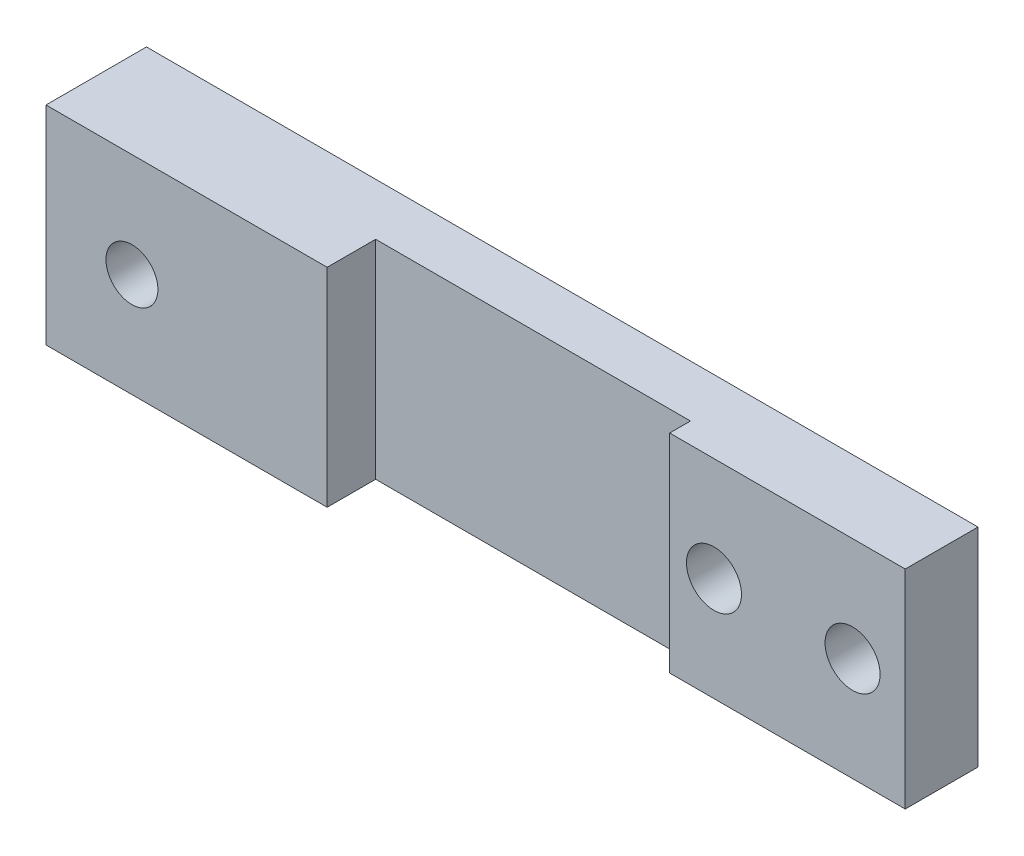
ISO-10303-21;
HEADER;
FILE_DESCRIPTION(('STEP AP214'),'2;1');
FILE_NAME('part.step','',(''),(''),'','','');
FILE_SCHEMA(('AUTOMOTIVE_DESIGN { 1 0 10303 214 1 1 1 1 }'));
ENDSEC;
DATA;
#1=APPLICATION_CONTEXT('core data for automotive mechanical design processes');
#2=APPLICATION_PROTOCOL_DEFINITION('international standard','automotive_design',2000,#1);
#3=PRODUCT_CONTEXT('',#1,'mechanical');
#4=PRODUCT('Part','Part','',(#3));
#5=PRODUCT_RELATED_PRODUCT_CATEGORY('part','',(#4));
#6=PRODUCT_DEFINITION_FORMATION('','',#4);
#7=PRODUCT_DEFINITION_CONTEXT('part definition',#1,'design');
#8=PRODUCT_DEFINITION('design','',#6,#7);
#9=PRODUCT_DEFINITION_SHAPE('','',#8);
#10=(LENGTH_UNIT() NAMED_UNIT(*) SI_UNIT(.MILLI.,.METRE.));
#11=(NAMED_UNIT(*) PLANE_ANGLE_UNIT() SI_UNIT($,.RADIAN.));
#12=(NAMED_UNIT(*) SI_UNIT($,.STERADIAN.) SOLID_ANGLE_UNIT());
#13=UNCERTAINTY_MEASURE_WITH_UNIT(LENGTH_MEASURE(1.E-05),#10,'distance_accuracy_value','');
#14=(GEOMETRIC_REPRESENTATION_CONTEXT(3) GLOBAL_UNCERTAINTY_ASSIGNED_CONTEXT((#13)) GLOBAL_UNIT_ASSIGNED_CONTEXT((#10,
#11,#12)) REPRESENTATION_CONTEXT('',''));
#15=CARTESIAN_POINT('',(0.,0.,0.));
#16=DIRECTION('',(0.,0.,1.));
#17=DIRECTION('',(1.,0.,0.));
#18=AXIS2_PLACEMENT_3D('',#15,#16,#17);
#19=CARTESIAN_POINT('',(0.,0.,9.525));
#20=DIRECTION('',(0.,0.,-1.));
#21=DIRECTION('',(-1.,0.,0.));
#22=AXIS2_PLACEMENT_3D('',#19,#20,#21);
#23=PLANE('',#22);
#24=DIRECTION('',(0.,1.,0.));
#25=VECTOR('',#24,1.);
#26=CARTESIAN_POINT('',(-24.6715220562594,-19.05,9.525));
#27=LINE('',#26,#25);
#28=CARTESIAN_POINT('',(-24.6715220562594,-19.05,9.525));
#29=VERTEX_POINT('',#28);
#30=CARTESIAN_POINT('',(-24.6715220562594,19.05,9.525));
#31=VERTEX_POINT('',#30);
#32=EDGE_CURVE('E47',#29,#31,#27,.T.);
#33=ORIENTED_EDGE('',*,*,#32,.F.);
#34=DIRECTION('',(1.,0.,0.));
#35=VECTOR('',#34,1.);
#36=CARTESIAN_POINT('',(76.2,-19.05,9.525));
#37=LINE('',#36,#35);
#38=CARTESIAN_POINT('',(33.02,-19.05,9.525));
#39=VERTEX_POINT('',#38);
#40=EDGE_CURVE('E159',#29,#39,#37,.T.);
#41=ORIENTED_EDGE('',*,*,#40,.T.);
#42=DIRECTION('',(0.,-1.,0.));
#43=VECTOR('',#42,1.);
#44=CARTESIAN_POINT('',(33.02,19.05,9.525));
#45=LINE('',#44,#43);
#46=CARTESIAN_POINT('',(33.02,19.05,9.525));
#47=VERTEX_POINT('',#46);
#48=EDGE_CURVE('E138',#47,#39,#45,.T.);
#49=ORIENTED_EDGE('',*,*,#48,.F.);
#50=DIRECTION('',(-1.,0.,0.));
#51=VECTOR('',#50,1.);
#52=CARTESIAN_POINT('',(76.2,19.05,9.525));
#53=LINE('',#52,#51);
#54=EDGE_CURVE('E52',#47,#31,#53,.T.);
#55=ORIENTED_EDGE('',*,*,#54,.T.);
#56=EDGE_LOOP('',(#33,#41,#49,#55));
#57=FACE_BOUND('',#56,.T.);
#58=ADVANCED_FACE('F32',(#57),#23,.F.);
#59=CARTESIAN_POINT('',(-76.2,19.05,9.525));
#60=DIRECTION('',(1.,0.,0.));
#61=DIRECTION('',(0.,1.,0.));
#62=AXIS2_PLACEMENT_3D('',#59,#60,#61);
#63=PLANE('',#62);
#64=DIRECTION('',(0.,-1.,0.));
#65=VECTOR('',#64,1.);
#66=CARTESIAN_POINT('',(-76.2,19.05,0.));
#67=LINE('',#66,#65);
#68=CARTESIAN_POINT('',(-76.2,19.05,0.));
#69=VERTEX_POINT('',#68);
#70=CARTESIAN_POINT('',(-76.2,-19.05,0.));
#71=VERTEX_POINT('',#70);
#72=EDGE_CURVE('E158',#69,#71,#67,.T.);
#73=ORIENTED_EDGE('',*,*,#72,.T.);
#74=DIRECTION('',(0.,0.,-1.));
#75=VECTOR('',#74,1.);
#76=CARTESIAN_POINT('',(-76.2,-19.05,9.525));
#77=LINE('',#76,#75);
#78=CARTESIAN_POINT('',(-76.2,-19.05,18.415));
#79=VERTEX_POINT('',#78);
#80=EDGE_CURVE('E11',#79,#71,#77,.T.);
#81=ORIENTED_EDGE('',*,*,#80,.F.);
#82=DIRECTION('',(0.,-1.,0.));
#83=VECTOR('',#82,1.);
#84=CARTESIAN_POINT('',(-76.2,19.05,18.415));
#85=LINE('',#84,#83);
#86=CARTESIAN_POINT('',(-76.2,19.05,18.415));
#87=VERTEX_POINT('',#86);
#88=EDGE_CURVE('E110',#87,#79,#85,.T.);
#89=ORIENTED_EDGE('',*,*,#88,.F.);
#90=DIRECTION('',(0.,0.,-1.));
#91=VECTOR('',#90,1.);
#92=CARTESIAN_POINT('',(-76.2,19.05,9.525));
#93=LINE('',#92,#91);
#94=EDGE_CURVE('E95',#87,#69,#93,.T.);
#95=ORIENTED_EDGE('',*,*,#94,.T.);
#96=EDGE_LOOP('',(#73,#81,#89,#95));
#97=FACE_BOUND('',#96,.T.);
#98=ADVANCED_FACE('F34',(#97),#63,.F.);
#99=CARTESIAN_POINT('',(76.2,-19.05,9.525));
#100=DIRECTION('',(0.,1.,0.));
#101=DIRECTION('',(-1.,0.,0.));
#102=AXIS2_PLACEMENT_3D('',#99,#100,#101);
#103=PLANE('',#102);
#104=DIRECTION('',(1.,0.,0.));
#105=VECTOR('',#104,1.);
#106=CARTESIAN_POINT('',(76.2,-19.05,0.));
#107=LINE('',#106,#105);
#108=CARTESIAN_POINT('',(76.2,-19.05,0.));
#109=VERTEX_POINT('',#108);
#110=EDGE_CURVE('E163',#71,#109,#107,.T.);
#111=ORIENTED_EDGE('',*,*,#110,.T.);
#112=DIRECTION('',(0.,0.,-1.));
#113=VECTOR('',#112,1.);
#114=CARTESIAN_POINT('',(76.2,-19.05,9.525));
#115=LINE('',#114,#113);
#116=CARTESIAN_POINT('',(76.2,-19.05,13.335));
#117=VERTEX_POINT('',#116);
#118=EDGE_CURVE('E40',#117,#109,#115,.T.);
#119=ORIENTED_EDGE('',*,*,#118,.F.);
#120=DIRECTION('',(1.,0.,0.));
#121=VECTOR('',#120,1.);
#122=CARTESIAN_POINT('',(33.02,-19.05,13.335));
#123=LINE('',#122,#121);
#124=CARTESIAN_POINT('',(33.02,-19.05,13.335));
#125=VERTEX_POINT('',#124);
#126=EDGE_CURVE('E144',#125,#117,#123,.T.);
#127=ORIENTED_EDGE('',*,*,#126,.F.);
#128=DIRECTION('',(0.,0.,-1.));
#129=VECTOR('',#128,1.);
#130=CARTESIAN_POINT('',(33.02,-19.05,13.335));
#131=LINE('',#130,#129);
#132=EDGE_CURVE('E150',#125,#39,#131,.T.);
#133=ORIENTED_EDGE('',*,*,#132,.T.);
#134=ORIENTED_EDGE('',*,*,#40,.F.);
#135=DIRECTION('',(0.,0.,-1.));
#136=VECTOR('',#135,1.);
#137=CARTESIAN_POINT('',(-24.6715220562594,-19.05,18.415));
#138=LINE('',#137,#136);
#139=CARTESIAN_POINT('',(-24.6715220562594,-19.05,18.415));
#140=VERTEX_POINT('',#139);
#141=EDGE_CURVE('E129',#140,#29,#138,.T.);
#142=ORIENTED_EDGE('',*,*,#141,.F.);
#143=DIRECTION('',(1.,0.,0.));
#144=VECTOR('',#143,1.);
#145=CARTESIAN_POINT('',(-76.2,-19.05,18.415));
#146=LINE('',#145,#144);
#147=EDGE_CURVE('E113',#79,#140,#146,.T.);
#148=ORIENTED_EDGE('',*,*,#147,.F.);
#149=ORIENTED_EDGE('',*,*,#80,.T.);
#150=EDGE_LOOP('',(#111,#119,#127,#133,#134,#142,#148,#149));
#151=FACE_BOUND('',#150,.T.);
#152=ADVANCED_FACE('F177',(#151),#103,.F.);
#153=CARTESIAN_POINT('',(76.2,19.05,9.525));
#154=DIRECTION('',(-1.,0.,0.));
#155=DIRECTION('',(0.,0.,1.));
#156=AXIS2_PLACEMENT_3D('',#153,#154,#155);
#157=PLANE('',#156);
#158=DIRECTION('',(0.,1.,0.));
#159=VECTOR('',#158,1.);
#160=CARTESIAN_POINT('',(76.2,19.05,0.));
#161=LINE('',#160,#159);
#162=CARTESIAN_POINT('',(76.2,19.05,0.));
#163=VERTEX_POINT('',#162);
#164=EDGE_CURVE('E165',#109,#163,#161,.T.);
#165=ORIENTED_EDGE('',*,*,#164,.T.);
#166=DIRECTION('',(0.,0.,-1.));
#167=VECTOR('',#166,1.);
#168=CARTESIAN_POINT('',(76.2,19.05,9.525));
#169=LINE('',#168,#167);
#170=CARTESIAN_POINT('',(76.2,19.05,13.335));
#171=VERTEX_POINT('',#170);
#172=EDGE_CURVE('E107',#171,#163,#169,.T.);
#173=ORIENTED_EDGE('',*,*,#172,.F.);
#174=DIRECTION('',(0.,1.,0.));
#175=VECTOR('',#174,1.);
#176=CARTESIAN_POINT('',(76.2,-19.05,13.335));
#177=LINE('',#176,#175);
#178=EDGE_CURVE('E147',#117,#171,#177,.T.);
#179=ORIENTED_EDGE('',*,*,#178,.F.);
#180=ORIENTED_EDGE('',*,*,#118,.T.);
#181=EDGE_LOOP('',(#165,#173,#179,#180));
#182=FACE_BOUND('',#181,.T.);
#183=ADVANCED_FACE('F172',(#182),#157,.F.);
#184=CARTESIAN_POINT('',(76.2,19.05,9.525));
#185=DIRECTION('',(0.,-1.,0.));
#186=DIRECTION('',(1.,0.,0.));
#187=AXIS2_PLACEMENT_3D('',#184,#185,#186);
#188=PLANE('',#187);
#189=DIRECTION('',(-1.,0.,0.));
#190=VECTOR('',#189,1.);
#191=CARTESIAN_POINT('',(76.2,19.05,0.));
#192=LINE('',#191,#190);
#193=EDGE_CURVE('E103',#163,#69,#192,.T.);
#194=ORIENTED_EDGE('',*,*,#193,.T.);
#195=ORIENTED_EDGE('',*,*,#94,.F.);
#196=DIRECTION('',(-1.,0.,0.));
#197=VECTOR('',#196,1.);
#198=CARTESIAN_POINT('',(-24.6715220562594,19.05,18.415));
#199=LINE('',#198,#197);
#200=CARTESIAN_POINT('',(-24.6715220562594,19.05,18.415));
#201=VERTEX_POINT('',#200);
#202=EDGE_CURVE('E100',#201,#87,#199,.T.);
#203=ORIENTED_EDGE('',*,*,#202,.F.);
#204=DIRECTION('',(0.,0.,-1.));
#205=VECTOR('',#204,1.);
#206=CARTESIAN_POINT('',(-24.6715220562594,19.05,18.415));
#207=LINE('',#206,#205);
#208=EDGE_CURVE('E126',#201,#31,#207,.T.);
#209=ORIENTED_EDGE('',*,*,#208,.T.);
#210=ORIENTED_EDGE('',*,*,#54,.F.);
#211=DIRECTION('',(0.,0.,-1.));
#212=VECTOR('',#211,1.);
#213=CARTESIAN_POINT('',(33.02,19.05,13.335));
#214=LINE('',#213,#212);
#215=CARTESIAN_POINT('',(33.02,19.05,13.335));
#216=VERTEX_POINT('',#215);
#217=EDGE_CURVE('E155',#216,#47,#214,.T.);
#218=ORIENTED_EDGE('',*,*,#217,.F.);
#219=DIRECTION('',(-1.,0.,0.));
#220=VECTOR('',#219,1.);
#221=CARTESIAN_POINT('',(76.2,19.05,13.335));
#222=LINE('',#221,#220);
#223=EDGE_CURVE('E139',#171,#216,#222,.T.);
#224=ORIENTED_EDGE('',*,*,#223,.F.);
#225=ORIENTED_EDGE('',*,*,#172,.T.);
#226=EDGE_LOOP('',(#194,#195,#203,#209,#210,#218,#224,#225));
#227=FACE_BOUND('',#226,.T.);
#228=ADVANCED_FACE('F97',(#227),#188,.F.);
#229=CARTESIAN_POINT('',(0.,0.,0.));
#230=DIRECTION('',(0.,0.,-1.));
#231=DIRECTION('',(-1.,0.,0.));
#232=AXIS2_PLACEMENT_3D('',#229,#230,#231);
#233=PLANE('',#232);
#234=CARTESIAN_POINT('',(-60.452,0.,0.));
#235=DIRECTION('',(0.,0.,1.));
#236=DIRECTION('',(1.,0.,0.));
#237=AXIS2_PLACEMENT_3D('',#234,#235,#236);
#238=CIRCLE('',#237,4.7625);
#239=CARTESIAN_POINT('',(-55.6895,0.,0.));
#240=VERTEX_POINT('',#239);
#241=EDGE_CURVE('E316',#240,#240,#238,.T.);
#242=ORIENTED_EDGE('',*,*,#241,.T.);
#243=EDGE_LOOP('',(#242));
#244=FACE_BOUND('',#243,.T.);
#245=CARTESIAN_POINT('',(66.548,0.,0.));
#246=DIRECTION('',(0.,0.,-1.));
#247=DIRECTION('',(-1.,0.,0.));
#248=AXIS2_PLACEMENT_3D('',#245,#246,#247);
#249=CIRCLE('',#248,5.04189999999999);
#250=CARTESIAN_POINT('',(61.5061,0.,0.));
#251=VERTEX_POINT('',#250);
#252=EDGE_CURVE('E321',#251,#251,#249,.T.);
#253=ORIENTED_EDGE('',*,*,#252,.F.);
#254=EDGE_LOOP('',(#253));
#255=FACE_BOUND('',#254,.T.);
#256=CARTESIAN_POINT('',(41.148,0.,0.));
#257=DIRECTION('',(0.,0.,-1.));
#258=DIRECTION('',(-1.,0.,0.));
#259=AXIS2_PLACEMENT_3D('',#256,#257,#258);
#260=CIRCLE('',#259,5.04189999999999);
#261=CARTESIAN_POINT('',(36.1061,0.,0.));
#262=VERTEX_POINT('',#261);
#263=EDGE_CURVE('E120',#262,#262,#260,.T.);
#264=ORIENTED_EDGE('',*,*,#263,.F.);
#265=EDGE_LOOP('',(#264));
#266=FACE_BOUND('',#265,.T.);
#267=ORIENTED_EDGE('',*,*,#72,.F.);
#268=ORIENTED_EDGE('',*,*,#193,.F.);
#269=ORIENTED_EDGE('',*,*,#164,.F.);
#270=ORIENTED_EDGE('',*,*,#110,.F.);
#271=EDGE_LOOP('',(#267,#268,#269,#270));
#272=FACE_BOUND('',#271,.T.);
#273=ADVANCED_FACE('F176',(#244,#255,#266,#272),#233,.T.);
#274=CARTESIAN_POINT('',(33.02,19.05,13.335));
#275=DIRECTION('',(1.,0.,0.));
#276=DIRECTION('',(0.,0.,-1.));
#277=AXIS2_PLACEMENT_3D('',#274,#275,#276);
#278=PLANE('',#277);
#279=ORIENTED_EDGE('',*,*,#48,.T.);
#280=ORIENTED_EDGE('',*,*,#132,.F.);
#281=DIRECTION('',(0.,-1.,0.));
#282=VECTOR('',#281,1.);
#283=CARTESIAN_POINT('',(33.02,19.05,13.335));
#284=LINE('',#283,#282);
#285=EDGE_CURVE('E142',#216,#125,#284,.T.);
#286=ORIENTED_EDGE('',*,*,#285,.F.);
#287=ORIENTED_EDGE('',*,*,#217,.T.);
#288=EDGE_LOOP('',(#279,#280,#286,#287));
#289=FACE_BOUND('',#288,.T.);
#290=ADVANCED_FACE('F184',(#289),#278,.F.);
#291=CARTESIAN_POINT('',(0.,0.,13.335));
#292=DIRECTION('',(0.,0.,1.));
#293=DIRECTION('',(1.,0.,0.));
#294=AXIS2_PLACEMENT_3D('',#291,#292,#293);
#295=PLANE('',#294);
#296=CARTESIAN_POINT('',(41.148,0.,13.335));
#297=DIRECTION('',(0.,0.,-1.));
#298=DIRECTION('',(-1.,0.,0.));
#299=AXIS2_PLACEMENT_3D('',#296,#297,#298);
#300=CIRCLE('',#299,5.04189999999999);
#301=CARTESIAN_POINT('',(36.1061,0.,13.335));
#302=VERTEX_POINT('',#301);
#303=EDGE_CURVE('E132',#302,#302,#300,.T.);
#304=ORIENTED_EDGE('',*,*,#303,.T.);
#305=EDGE_LOOP('',(#304));
#306=FACE_BOUND('',#305,.T.);
#307=CARTESIAN_POINT('',(66.548,0.,13.335));
#308=DIRECTION('',(0.,0.,-1.));
#309=DIRECTION('',(-1.,0.,0.));
#310=AXIS2_PLACEMENT_3D('',#307,#308,#309);
#311=CIRCLE('',#310,5.0419);
#312=CARTESIAN_POINT('',(61.5061,0.,13.335));
#313=VERTEX_POINT('',#312);
#314=EDGE_CURVE('E135',#313,#313,#311,.T.);
#315=ORIENTED_EDGE('',*,*,#314,.T.);
#316=EDGE_LOOP('',(#315));
#317=FACE_BOUND('',#316,.T.);
#318=ORIENTED_EDGE('',*,*,#223,.T.);
#319=ORIENTED_EDGE('',*,*,#285,.T.);
#320=ORIENTED_EDGE('',*,*,#126,.T.);
#321=ORIENTED_EDGE('',*,*,#178,.T.);
#322=EDGE_LOOP('',(#318,#319,#320,#321));
#323=FACE_BOUND('',#322,.T.);
#324=ADVANCED_FACE('F187',(#306,#317,#323),#295,.T.);
#325=CARTESIAN_POINT('',(66.548,0.,9.525));
#326=DIRECTION('',(0.,0.,-1.));
#327=DIRECTION('',(-1.,0.,0.));
#328=AXIS2_PLACEMENT_3D('',#325,#326,#327);
#329=CYLINDRICAL_SURFACE('',#328,5.04189999999999);
#330=ORIENTED_EDGE('',*,*,#314,.F.);
#331=EDGE_LOOP('',(#330));
#332=FACE_BOUND('',#331,.T.);
#333=ORIENTED_EDGE('',*,*,#252,.T.);
#334=EDGE_LOOP('',(#333));
#335=FACE_BOUND('',#334,.T.);
#336=ADVANCED_FACE('F189',(#332,#335),#329,.F.);
#337=CARTESIAN_POINT('',(41.148,0.,9.525));
#338=DIRECTION('',(0.,0.,-1.));
#339=DIRECTION('',(-1.,0.,0.));
#340=AXIS2_PLACEMENT_3D('',#337,#338,#339);
#341=CYLINDRICAL_SURFACE('',#340,5.04189999999999);
#342=ORIENTED_EDGE('',*,*,#303,.F.);
#343=EDGE_LOOP('',(#342));
#344=FACE_BOUND('',#343,.T.);
#345=ORIENTED_EDGE('',*,*,#263,.T.);
#346=EDGE_LOOP('',(#345));
#347=FACE_BOUND('',#346,.T.);
#348=ADVANCED_FACE('F196',(#344,#347),#341,.F.);
#349=CARTESIAN_POINT('',(-24.6715220562594,-19.05,18.415));
#350=DIRECTION('',(-1.,0.,0.));
#351=DIRECTION('',(0.,0.,1.));
#352=AXIS2_PLACEMENT_3D('',#349,#350,#351);
#353=PLANE('',#352);
#354=ORIENTED_EDGE('',*,*,#32,.T.);
#355=ORIENTED_EDGE('',*,*,#208,.F.);
#356=DIRECTION('',(0.,1.,0.));
#357=VECTOR('',#356,1.);
#358=CARTESIAN_POINT('',(-24.6715220562594,-19.05,18.415));
#359=LINE('',#358,#357);
#360=EDGE_CURVE('E117',#140,#201,#359,.T.);
#361=ORIENTED_EDGE('',*,*,#360,.F.);
#362=ORIENTED_EDGE('',*,*,#141,.T.);
#363=EDGE_LOOP('',(#354,#355,#361,#362));
#364=FACE_BOUND('',#363,.T.);
#365=ADVANCED_FACE('F180',(#364),#353,.F.);
#366=CARTESIAN_POINT('',(0.,0.,18.415));
#367=DIRECTION('',(0.,0.,1.));
#368=DIRECTION('',(1.,0.,0.));
#369=AXIS2_PLACEMENT_3D('',#366,#367,#368);
#370=PLANE('',#369);
#371=CARTESIAN_POINT('',(-60.452,0.,18.415));
#372=DIRECTION('',(0.,0.,1.));
#373=DIRECTION('',(1.,0.,0.));
#374=AXIS2_PLACEMENT_3D('',#371,#372,#373);
#375=CIRCLE('',#374,4.7625);
#376=CARTESIAN_POINT('',(-55.6895,0.,18.415));
#377=VERTEX_POINT('',#376);
#378=EDGE_CURVE('E319',#377,#377,#375,.T.);
#379=ORIENTED_EDGE('',*,*,#378,.F.);
#380=EDGE_LOOP('',(#379));
#381=FACE_BOUND('',#380,.T.);
#382=ORIENTED_EDGE('',*,*,#202,.T.);
#383=ORIENTED_EDGE('',*,*,#88,.T.);
#384=ORIENTED_EDGE('',*,*,#147,.T.);
#385=ORIENTED_EDGE('',*,*,#360,.T.);
#386=EDGE_LOOP('',(#382,#383,#384,#385));
#387=FACE_BOUND('',#386,.T.);
#388=ADVANCED_FACE('F115',(#381,#387),#370,.T.);
#389=CARTESIAN_POINT('',(-60.452,0.,0.));
#390=DIRECTION('',(0.,0.,1.));
#391=DIRECTION('',(1.,0.,0.));
#392=AXIS2_PLACEMENT_3D('',#389,#390,#391);
#393=CYLINDRICAL_SURFACE('',#392,4.7625);
#394=ORIENTED_EDGE('',*,*,#241,.F.);
#395=EDGE_LOOP('',(#394));
#396=FACE_BOUND('',#395,.T.);
#397=ORIENTED_EDGE('',*,*,#378,.T.);
#398=EDGE_LOOP('',(#397));
#399=FACE_BOUND('',#398,.T.);
#400=ADVANCED_FACE('F282',(#396,#399),#393,.F.);
#401=CLOSED_SHELL('',(#58,#98,#152,#183,#228,#273,#290,#324,#336,#348,#365,#388,#400));
#402=MANIFOLD_SOLID_BREP('B2',#401);
#403=ADVANCED_BREP_SHAPE_REPRESENTATION('',(#18,#402),#14);
#404=SHAPE_DEFINITION_REPRESENTATION(#9,#403);
ENDSEC;
END-ISO-10303-21;
